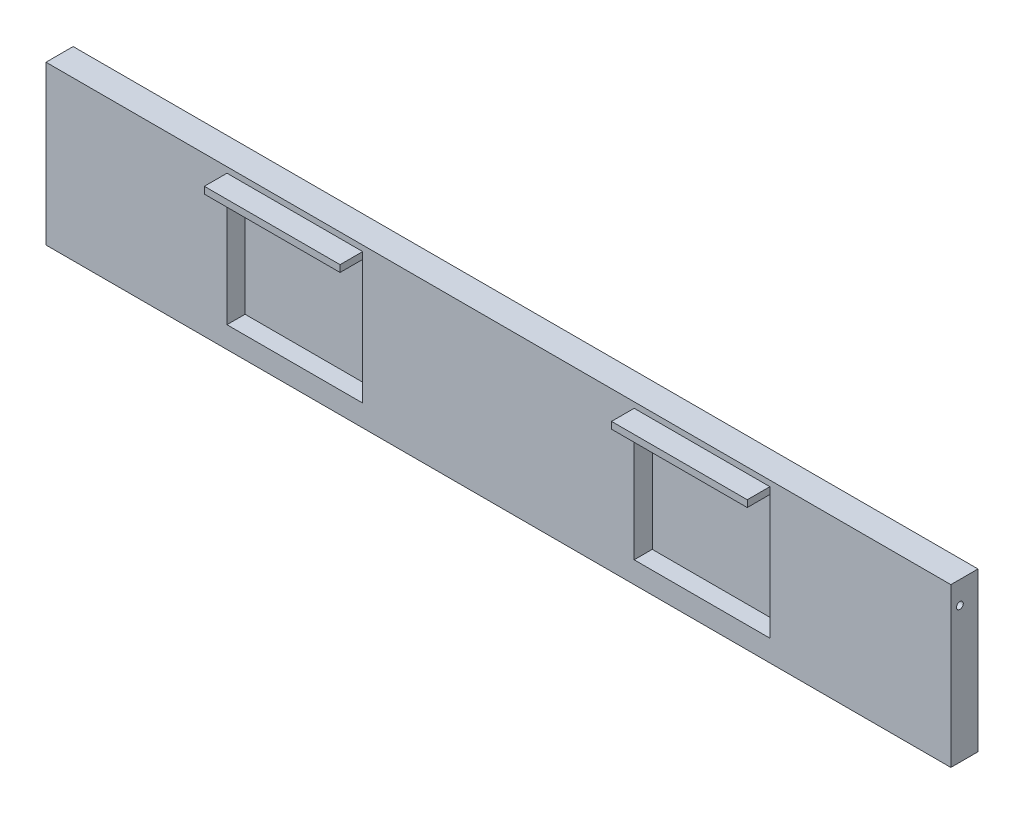
ISO-10303-21;
HEADER;
FILE_DESCRIPTION(('STEP AP214'),'2;1');
FILE_NAME('part.step','',(''),(''),'','','');
FILE_SCHEMA(('AUTOMOTIVE_DESIGN { 1 0 10303 214 1 1 1 1 }'));
ENDSEC;
DATA;
#1=APPLICATION_CONTEXT('core data for automotive mechanical design processes');
#2=APPLICATION_PROTOCOL_DEFINITION('international standard','automotive_design',2000,#1);
#3=PRODUCT_CONTEXT('',#1,'mechanical');
#4=PRODUCT('Part','Part','',(#3));
#5=PRODUCT_RELATED_PRODUCT_CATEGORY('part','',(#4));
#6=PRODUCT_DEFINITION_FORMATION('','',#4);
#7=PRODUCT_DEFINITION_CONTEXT('part definition',#1,'design');
#8=PRODUCT_DEFINITION('design','',#6,#7);
#9=PRODUCT_DEFINITION_SHAPE('','',#8);
#10=(LENGTH_UNIT() NAMED_UNIT(*) SI_UNIT(.MILLI.,.METRE.));
#11=(NAMED_UNIT(*) PLANE_ANGLE_UNIT() SI_UNIT($,.RADIAN.));
#12=(NAMED_UNIT(*) SI_UNIT($,.STERADIAN.) SOLID_ANGLE_UNIT());
#13=UNCERTAINTY_MEASURE_WITH_UNIT(LENGTH_MEASURE(1.E-05),#10,'distance_accuracy_value','');
#14=(GEOMETRIC_REPRESENTATION_CONTEXT(3) GLOBAL_UNCERTAINTY_ASSIGNED_CONTEXT((#13)) GLOBAL_UNIT_ASSIGNED_CONTEXT((#10,
#11,#12)) REPRESENTATION_CONTEXT('',''));
#15=CARTESIAN_POINT('',(0.,0.,0.));
#16=DIRECTION('',(0.,0.,1.));
#17=DIRECTION('',(1.,0.,0.));
#18=AXIS2_PLACEMENT_3D('',#15,#16,#17);
#19=CARTESIAN_POINT('',(0.,0.,12.));
#20=DIRECTION('',(0.,0.,-1.));
#21=DIRECTION('',(-1.,0.,0.));
#22=AXIS2_PLACEMENT_3D('',#19,#20,#21);
#23=PLANE('',#22);
#24=DIRECTION('',(0.,-1.,0.));
#25=VECTOR('',#24,1.);
#26=CARTESIAN_POINT('',(60.,29.5,12.));
#27=LINE('',#26,#25);
#28=CARTESIAN_POINT('',(60.,32.5,12.));
#29=VERTEX_POINT('',#28);
#30=CARTESIAN_POINT('',(60.,29.5,12.));
#31=VERTEX_POINT('',#30);
#32=EDGE_CURVE('E54',#29,#31,#27,.T.);
#33=ORIENTED_EDGE('',*,*,#32,.F.);
#34=DIRECTION('',(-1.,0.,0.));
#35=VECTOR('',#34,1.);
#36=CARTESIAN_POINT('',(120.,32.5,12.));
#37=LINE('',#36,#35);
#38=CARTESIAN_POINT('',(120.,32.5,12.));
#39=VERTEX_POINT('',#38);
#40=EDGE_CURVE('E192',#39,#29,#37,.T.);
#41=ORIENTED_EDGE('',*,*,#40,.F.);
#42=DIRECTION('',(0.,1.,0.));
#43=VECTOR('',#42,1.);
#44=CARTESIAN_POINT('',(120.,29.5,12.));
#45=LINE('',#44,#43);
#46=CARTESIAN_POINT('',(120.,29.5,12.));
#47=VERTEX_POINT('',#46);
#48=EDGE_CURVE('E189',#47,#39,#45,.T.);
#49=ORIENTED_EDGE('',*,*,#48,.F.);
#50=DIRECTION('',(0.,1.,0.));
#51=VECTOR('',#50,1.);
#52=CARTESIAN_POINT('',(120.,29.5,12.));
#53=LINE('',#52,#51);
#54=CARTESIAN_POINT('',(120.,-25.5,12.));
#55=VERTEX_POINT('',#54);
#56=EDGE_CURVE('E271',#55,#47,#53,.T.);
#57=ORIENTED_EDGE('',*,*,#56,.F.);
#58=DIRECTION('',(1.,0.,0.));
#59=VECTOR('',#58,1.);
#60=CARTESIAN_POINT('',(60.,-25.5,12.));
#61=LINE('',#60,#59);
#62=CARTESIAN_POINT('',(60.,-25.5,12.));
#63=VERTEX_POINT('',#62);
#64=EDGE_CURVE('E282',#63,#55,#61,.T.);
#65=ORIENTED_EDGE('',*,*,#64,.F.);
#66=DIRECTION('',(0.,-1.,0.));
#67=VECTOR('',#66,1.);
#68=CARTESIAN_POINT('',(60.,29.5,12.));
#69=LINE('',#68,#67);
#70=EDGE_CURVE('E61',#31,#63,#69,.T.);
#71=ORIENTED_EDGE('',*,*,#70,.F.);
#72=EDGE_LOOP('',(#33,#41,#49,#57,#65,#71));
#73=FACE_BOUND('',#72,.T.);
#74=DIRECTION('',(0.,1.,0.));
#75=VECTOR('',#74,1.);
#76=CARTESIAN_POINT('',(200.,-35.,12.));
#77=LINE('',#76,#75);
#78=CARTESIAN_POINT('',(200.,-35.,12.));
#79=VERTEX_POINT('',#78);
#80=CARTESIAN_POINT('',(200.,35.,12.));
#81=VERTEX_POINT('',#80);
#82=EDGE_CURVE('E294',#79,#81,#77,.T.);
#83=ORIENTED_EDGE('',*,*,#82,.T.);
#84=DIRECTION('',(-1.,0.,0.));
#85=VECTOR('',#84,1.);
#86=CARTESIAN_POINT('',(-200.,35.,12.));
#87=LINE('',#86,#85);
#88=CARTESIAN_POINT('',(-200.,35.,12.));
#89=VERTEX_POINT('',#88);
#90=EDGE_CURVE('E297',#81,#89,#87,.T.);
#91=ORIENTED_EDGE('',*,*,#90,.T.);
#92=DIRECTION('',(0.,-1.,0.));
#93=VECTOR('',#92,1.);
#94=CARTESIAN_POINT('',(-200.,-35.,12.));
#95=LINE('',#94,#93);
#96=CARTESIAN_POINT('',(-200.,-35.,12.));
#97=VERTEX_POINT('',#96);
#98=EDGE_CURVE('E300',#89,#97,#95,.T.);
#99=ORIENTED_EDGE('',*,*,#98,.T.);
#100=DIRECTION('',(1.,0.,0.));
#101=VECTOR('',#100,1.);
#102=CARTESIAN_POINT('',(-200.,-35.,12.));
#103=LINE('',#102,#101);
#104=EDGE_CURVE('E302',#97,#79,#103,.T.);
#105=ORIENTED_EDGE('',*,*,#104,.T.);
#106=EDGE_LOOP('',(#83,#91,#99,#105));
#107=FACE_BOUND('',#106,.T.);
#108=DIRECTION('',(0.,-1.,0.));
#109=VECTOR('',#108,1.);
#110=CARTESIAN_POINT('',(-120.,29.5,12.));
#111=LINE('',#110,#109);
#112=CARTESIAN_POINT('',(-120.,32.5,12.));
#113=VERTEX_POINT('',#112);
#114=CARTESIAN_POINT('',(-120.,29.5,12.));
#115=VERTEX_POINT('',#114);
#116=EDGE_CURVE('E188',#113,#115,#111,.T.);
#117=ORIENTED_EDGE('',*,*,#116,.F.);
#118=DIRECTION('',(-1.,0.,0.));
#119=VECTOR('',#118,1.);
#120=CARTESIAN_POINT('',(-120.,32.5,12.));
#121=LINE('',#120,#119);
#122=CARTESIAN_POINT('',(-60.,32.5,12.));
#123=VERTEX_POINT('',#122);
#124=EDGE_CURVE('E184',#123,#113,#121,.T.);
#125=ORIENTED_EDGE('',*,*,#124,.F.);
#126=DIRECTION('',(0.,1.,0.));
#127=VECTOR('',#126,1.);
#128=CARTESIAN_POINT('',(-60.,29.5,12.));
#129=LINE('',#128,#127);
#130=CARTESIAN_POINT('',(-60.,29.5,12.));
#131=VERTEX_POINT('',#130);
#132=EDGE_CURVE('E600',#131,#123,#129,.T.);
#133=ORIENTED_EDGE('',*,*,#132,.F.);
#134=DIRECTION('',(0.,1.,0.));
#135=VECTOR('',#134,1.);
#136=CARTESIAN_POINT('',(-60.,29.5,12.));
#137=LINE('',#136,#135);
#138=CARTESIAN_POINT('',(-60.,-25.5,12.));
#139=VERTEX_POINT('',#138);
#140=EDGE_CURVE('E250',#139,#131,#137,.T.);
#141=ORIENTED_EDGE('',*,*,#140,.F.);
#142=DIRECTION('',(1.,0.,0.));
#143=VECTOR('',#142,1.);
#144=CARTESIAN_POINT('',(-60.,-25.5,12.));
#145=LINE('',#144,#143);
#146=CARTESIAN_POINT('',(-120.,-25.5,12.));
#147=VERTEX_POINT('',#146);
#148=EDGE_CURVE('E240',#147,#139,#145,.T.);
#149=ORIENTED_EDGE('',*,*,#148,.F.);
#150=DIRECTION('',(0.,-1.,0.));
#151=VECTOR('',#150,1.);
#152=CARTESIAN_POINT('',(-120.,29.5,12.));
#153=LINE('',#152,#151);
#154=EDGE_CURVE('E253',#115,#147,#153,.T.);
#155=ORIENTED_EDGE('',*,*,#154,.F.);
#156=EDGE_LOOP('',(#117,#125,#133,#141,#149,#155));
#157=FACE_BOUND('',#156,.T.);
#158=ADVANCED_FACE('F38',(#73,#107,#157),#23,.F.);
#159=CARTESIAN_POINT('',(200.,-35.,12.));
#160=DIRECTION('',(-1.,0.,0.));
#161=DIRECTION('',(0.,0.,1.));
#162=AXIS2_PLACEMENT_3D('',#159,#160,#161);
#163=PLANE('',#162);
#164=CARTESIAN_POINT('',(200.,25.,8.));
#165=DIRECTION('',(-1.,0.,0.));
#166=DIRECTION('',(0.,0.,1.));
#167=AXIS2_PLACEMENT_3D('',#164,#165,#166);
#168=CIRCLE('',#167,1.5);
#169=CARTESIAN_POINT('',(200.,25.,9.5));
#170=VERTEX_POINT('',#169);
#171=EDGE_CURVE('E222',#170,#170,#168,.T.);
#172=ORIENTED_EDGE('',*,*,#171,.T.);
#173=EDGE_LOOP('',(#172));
#174=FACE_BOUND('',#173,.T.);
#175=DIRECTION('',(0.,1.,0.));
#176=VECTOR('',#175,1.);
#177=CARTESIAN_POINT('',(200.,-35.,0.));
#178=LINE('',#177,#176);
#179=CARTESIAN_POINT('',(200.,-35.,0.));
#180=VERTEX_POINT('',#179);
#181=CARTESIAN_POINT('',(200.,35.,0.));
#182=VERTEX_POINT('',#181);
#183=EDGE_CURVE('E261',#180,#182,#178,.T.);
#184=ORIENTED_EDGE('',*,*,#183,.T.);
#185=DIRECTION('',(0.,0.,-1.));
#186=VECTOR('',#185,1.);
#187=CARTESIAN_POINT('',(200.,35.,12.));
#188=LINE('',#187,#186);
#189=EDGE_CURVE('E11',#81,#182,#188,.T.);
#190=ORIENTED_EDGE('',*,*,#189,.F.);
#191=ORIENTED_EDGE('',*,*,#82,.F.);
#192=DIRECTION('',(0.,0.,-1.));
#193=VECTOR('',#192,1.);
#194=CARTESIAN_POINT('',(200.,-35.,12.));
#195=LINE('',#194,#193);
#196=EDGE_CURVE('E304',#79,#180,#195,.T.);
#197=ORIENTED_EDGE('',*,*,#196,.T.);
#198=EDGE_LOOP('',(#184,#190,#191,#197));
#199=FACE_BOUND('',#198,.T.);
#200=ADVANCED_FACE('F40',(#174,#199),#163,.F.);
#201=CARTESIAN_POINT('',(-200.,35.,12.));
#202=DIRECTION('',(0.,-1.,0.));
#203=DIRECTION('',(0.,0.,-1.));
#204=AXIS2_PLACEMENT_3D('',#201,#202,#203);
#205=PLANE('',#204);
#206=DIRECTION('',(-1.,0.,0.));
#207=VECTOR('',#206,1.);
#208=CARTESIAN_POINT('',(-200.,35.,0.));
#209=LINE('',#208,#207);
#210=CARTESIAN_POINT('',(-200.,35.,0.));
#211=VERTEX_POINT('',#210);
#212=EDGE_CURVE('E307',#182,#211,#209,.T.);
#213=ORIENTED_EDGE('',*,*,#212,.T.);
#214=DIRECTION('',(0.,0.,-1.));
#215=VECTOR('',#214,1.);
#216=CARTESIAN_POINT('',(-200.,35.,12.));
#217=LINE('',#216,#215);
#218=EDGE_CURVE('E47',#89,#211,#217,.T.);
#219=ORIENTED_EDGE('',*,*,#218,.F.);
#220=ORIENTED_EDGE('',*,*,#90,.F.);
#221=ORIENTED_EDGE('',*,*,#189,.T.);
#222=EDGE_LOOP('',(#213,#219,#220,#221));
#223=FACE_BOUND('',#222,.T.);
#224=ADVANCED_FACE('F338',(#223),#205,.F.);
#225=CARTESIAN_POINT('',(-200.,-35.,12.));
#226=DIRECTION('',(1.,0.,0.));
#227=DIRECTION('',(0.,0.,-1.));
#228=AXIS2_PLACEMENT_3D('',#225,#226,#227);
#229=PLANE('',#228);
#230=CARTESIAN_POINT('',(-200.,25.,8.));
#231=DIRECTION('',(-1.,0.,0.));
#232=DIRECTION('',(0.,0.,1.));
#233=AXIS2_PLACEMENT_3D('',#230,#231,#232);
#234=CIRCLE('',#233,1.5);
#235=CARTESIAN_POINT('',(-200.,25.,9.5));
#236=VERTEX_POINT('',#235);
#237=EDGE_CURVE('E221',#236,#236,#234,.T.);
#238=ORIENTED_EDGE('',*,*,#237,.F.);
#239=EDGE_LOOP('',(#238));
#240=FACE_BOUND('',#239,.T.);
#241=DIRECTION('',(0.,-1.,0.));
#242=VECTOR('',#241,1.);
#243=CARTESIAN_POINT('',(-200.,-35.,0.));
#244=LINE('',#243,#242);
#245=CARTESIAN_POINT('',(-200.,-35.,0.));
#246=VERTEX_POINT('',#245);
#247=EDGE_CURVE('E309',#211,#246,#244,.T.);
#248=ORIENTED_EDGE('',*,*,#247,.T.);
#249=DIRECTION('',(0.,0.,-1.));
#250=VECTOR('',#249,1.);
#251=CARTESIAN_POINT('',(-200.,-35.,12.));
#252=LINE('',#251,#250);
#253=EDGE_CURVE('E314',#97,#246,#252,.T.);
#254=ORIENTED_EDGE('',*,*,#253,.F.);
#255=ORIENTED_EDGE('',*,*,#98,.F.);
#256=ORIENTED_EDGE('',*,*,#218,.T.);
#257=EDGE_LOOP('',(#248,#254,#255,#256));
#258=FACE_BOUND('',#257,.T.);
#259=ADVANCED_FACE('F322',(#240,#258),#229,.F.);
#260=CARTESIAN_POINT('',(-200.,-35.,12.));
#261=DIRECTION('',(0.,1.,0.));
#262=DIRECTION('',(0.,0.,1.));
#263=AXIS2_PLACEMENT_3D('',#260,#261,#262);
#264=PLANE('',#263);
#265=DIRECTION('',(1.,0.,0.));
#266=VECTOR('',#265,1.);
#267=CARTESIAN_POINT('',(-200.,-35.,0.));
#268=LINE('',#267,#266);
#269=EDGE_CURVE('E298',#246,#180,#268,.T.);
#270=ORIENTED_EDGE('',*,*,#269,.T.);
#271=ORIENTED_EDGE('',*,*,#196,.F.);
#272=ORIENTED_EDGE('',*,*,#104,.F.);
#273=ORIENTED_EDGE('',*,*,#253,.T.);
#274=EDGE_LOOP('',(#270,#271,#272,#273));
#275=FACE_BOUND('',#274,.T.);
#276=ADVANCED_FACE('F331',(#275),#264,.F.);
#277=CARTESIAN_POINT('',(0.,0.,0.));
#278=DIRECTION('',(0.,0.,-1.));
#279=DIRECTION('',(-1.,0.,0.));
#280=AXIS2_PLACEMENT_3D('',#277,#278,#279);
#281=PLANE('',#280);
#282=ORIENTED_EDGE('',*,*,#183,.F.);
#283=ORIENTED_EDGE('',*,*,#269,.F.);
#284=ORIENTED_EDGE('',*,*,#247,.F.);
#285=ORIENTED_EDGE('',*,*,#212,.F.);
#286=EDGE_LOOP('',(#282,#283,#284,#285));
#287=FACE_BOUND('',#286,.T.);
#288=ADVANCED_FACE('F328',(#287),#281,.T.);
#289=CARTESIAN_POINT('',(60.,29.5,4.));
#290=DIRECTION('',(-1.,0.,0.));
#291=DIRECTION('',(0.,-1.,0.));
#292=AXIS2_PLACEMENT_3D('',#289,#290,#291);
#293=PLANE('',#292);
#294=CARTESIAN_POINT('',(60.,25.,8.));
#295=DIRECTION('',(-1.,0.,0.));
#296=DIRECTION('',(0.,-1.,0.));
#297=AXIS2_PLACEMENT_3D('',#294,#295,#296);
#298=CIRCLE('',#297,1.5);
#299=CARTESIAN_POINT('',(60.,23.5,8.));
#300=VERTEX_POINT('',#299);
#301=EDGE_CURVE('E233',#300,#300,#298,.T.);
#302=ORIENTED_EDGE('',*,*,#301,.T.);
#303=EDGE_LOOP('',(#302));
#304=FACE_BOUND('',#303,.T.);
#305=ORIENTED_EDGE('',*,*,#70,.T.);
#306=DIRECTION('',(0.,0.,1.));
#307=VECTOR('',#306,1.);
#308=CARTESIAN_POINT('',(60.,-25.5,4.));
#309=LINE('',#308,#307);
#310=CARTESIAN_POINT('',(60.,-25.5,4.));
#311=VERTEX_POINT('',#310);
#312=EDGE_CURVE('E280',#311,#63,#309,.T.);
#313=ORIENTED_EDGE('',*,*,#312,.F.);
#314=DIRECTION('',(0.,-1.,0.));
#315=VECTOR('',#314,1.);
#316=CARTESIAN_POINT('',(60.,29.5,4.));
#317=LINE('',#316,#315);
#318=CARTESIAN_POINT('',(60.,29.5,4.));
#319=VERTEX_POINT('',#318);
#320=EDGE_CURVE('E267',#319,#311,#317,.T.);
#321=ORIENTED_EDGE('',*,*,#320,.F.);
#322=DIRECTION('',(0.,0.,1.));
#323=VECTOR('',#322,1.);
#324=CARTESIAN_POINT('',(60.,29.5,4.));
#325=LINE('',#324,#323);
#326=EDGE_CURVE('E254',#319,#31,#325,.T.);
#327=ORIENTED_EDGE('',*,*,#326,.T.);
#328=EDGE_LOOP('',(#305,#313,#321,#327));
#329=FACE_BOUND('',#328,.T.);
#330=ADVANCED_FACE('F353',(#304,#329),#293,.F.);
#331=CARTESIAN_POINT('',(60.,29.5,4.));
#332=DIRECTION('',(0.,1.,0.));
#333=DIRECTION('',(-1.,0.,0.));
#334=AXIS2_PLACEMENT_3D('',#331,#332,#333);
#335=PLANE('',#334);
#336=DIRECTION('',(0.,0.,1.));
#337=VECTOR('',#336,1.);
#338=CARTESIAN_POINT('',(120.,29.5,4.));
#339=LINE('',#338,#337);
#340=CARTESIAN_POINT('',(120.,29.5,4.));
#341=VERTEX_POINT('',#340);
#342=EDGE_CURVE('E288',#341,#47,#339,.T.);
#343=ORIENTED_EDGE('',*,*,#342,.T.);
#344=DIRECTION('',(0.,0.,-1.));
#345=VECTOR('',#344,1.);
#346=CARTESIAN_POINT('',(120.,29.5,22.));
#347=LINE('',#346,#345);
#348=CARTESIAN_POINT('',(120.,29.5,22.));
#349=VERTEX_POINT('',#348);
#350=EDGE_CURVE('E218',#349,#47,#347,.T.);
#351=ORIENTED_EDGE('',*,*,#350,.F.);
#352=DIRECTION('',(1.,0.,0.));
#353=VECTOR('',#352,1.);
#354=CARTESIAN_POINT('',(120.,29.5,22.));
#355=LINE('',#354,#353);
#356=CARTESIAN_POINT('',(60.,29.5,22.));
#357=VERTEX_POINT('',#356);
#358=EDGE_CURVE('E198',#357,#349,#355,.T.);
#359=ORIENTED_EDGE('',*,*,#358,.F.);
#360=DIRECTION('',(0.,0.,-1.));
#361=VECTOR('',#360,1.);
#362=CARTESIAN_POINT('',(60.,29.5,22.));
#363=LINE('',#362,#361);
#364=EDGE_CURVE('E206',#357,#31,#363,.T.);
#365=ORIENTED_EDGE('',*,*,#364,.T.);
#366=ORIENTED_EDGE('',*,*,#326,.F.);
#367=DIRECTION('',(-1.,0.,0.));
#368=VECTOR('',#367,1.);
#369=CARTESIAN_POINT('',(60.,29.5,4.));
#370=LINE('',#369,#368);
#371=EDGE_CURVE('E277',#341,#319,#370,.T.);
#372=ORIENTED_EDGE('',*,*,#371,.F.);
#373=EDGE_LOOP('',(#343,#351,#359,#365,#366,#372));
#374=FACE_BOUND('',#373,.T.);
#375=ADVANCED_FACE('F373',(#374),#335,.F.);
#376=CARTESIAN_POINT('',(120.,29.5,4.));
#377=DIRECTION('',(1.,0.,0.));
#378=DIRECTION('',(0.,0.,-1.));
#379=AXIS2_PLACEMENT_3D('',#376,#377,#378);
#380=PLANE('',#379);
#381=CARTESIAN_POINT('',(120.,25.,8.));
#382=DIRECTION('',(1.,0.,0.));
#383=DIRECTION('',(0.,0.,-1.));
#384=AXIS2_PLACEMENT_3D('',#381,#382,#383);
#385=CIRCLE('',#384,1.5);
#386=CARTESIAN_POINT('',(120.,25.,6.5));
#387=VERTEX_POINT('',#386);
#388=EDGE_CURVE('E230',#387,#387,#385,.T.);
#389=ORIENTED_EDGE('',*,*,#388,.T.);
#390=EDGE_LOOP('',(#389));
#391=FACE_BOUND('',#390,.T.);
#392=ORIENTED_EDGE('',*,*,#56,.T.);
#393=ORIENTED_EDGE('',*,*,#342,.F.);
#394=DIRECTION('',(0.,1.,0.));
#395=VECTOR('',#394,1.);
#396=CARTESIAN_POINT('',(120.,29.5,4.));
#397=LINE('',#396,#395);
#398=CARTESIAN_POINT('',(120.,-25.5,4.));
#399=VERTEX_POINT('',#398);
#400=EDGE_CURVE('E274',#399,#341,#397,.T.);
#401=ORIENTED_EDGE('',*,*,#400,.F.);
#402=DIRECTION('',(0.,0.,1.));
#403=VECTOR('',#402,1.);
#404=CARTESIAN_POINT('',(120.,-25.5,4.));
#405=LINE('',#404,#403);
#406=EDGE_CURVE('E291',#399,#55,#405,.T.);
#407=ORIENTED_EDGE('',*,*,#406,.T.);
#408=EDGE_LOOP('',(#392,#393,#401,#407));
#409=FACE_BOUND('',#408,.T.);
#410=ADVANCED_FACE('F380',(#391,#409),#380,.F.);
#411=CARTESIAN_POINT('',(60.,-25.5,4.));
#412=DIRECTION('',(0.,-1.,0.));
#413=DIRECTION('',(0.,0.,-1.));
#414=AXIS2_PLACEMENT_3D('',#411,#412,#413);
#415=PLANE('',#414);
#416=ORIENTED_EDGE('',*,*,#64,.T.);
#417=ORIENTED_EDGE('',*,*,#406,.F.);
#418=DIRECTION('',(1.,0.,0.));
#419=VECTOR('',#418,1.);
#420=CARTESIAN_POINT('',(60.,-25.5,4.));
#421=LINE('',#420,#419);
#422=EDGE_CURVE('E270',#311,#399,#421,.T.);
#423=ORIENTED_EDGE('',*,*,#422,.F.);
#424=ORIENTED_EDGE('',*,*,#312,.T.);
#425=EDGE_LOOP('',(#416,#417,#423,#424));
#426=FACE_BOUND('',#425,.T.);
#427=ADVANCED_FACE('F388',(#426),#415,.F.);
#428=CARTESIAN_POINT('',(0.,0.,4.));
#429=DIRECTION('',(0.,0.,1.));
#430=DIRECTION('',(1.,0.,0.));
#431=AXIS2_PLACEMENT_3D('',#428,#429,#430);
#432=PLANE('',#431);
#433=ORIENTED_EDGE('',*,*,#320,.T.);
#434=ORIENTED_EDGE('',*,*,#422,.T.);
#435=ORIENTED_EDGE('',*,*,#400,.T.);
#436=ORIENTED_EDGE('',*,*,#371,.T.);
#437=EDGE_LOOP('',(#433,#434,#435,#436));
#438=FACE_BOUND('',#437,.T.);
#439=ADVANCED_FACE('F396',(#438),#432,.T.);
#440=CARTESIAN_POINT('',(-60.,29.5,4.));
#441=DIRECTION('',(1.,0.,0.));
#442=DIRECTION('',(0.,0.,-1.));
#443=AXIS2_PLACEMENT_3D('',#440,#441,#442);
#444=PLANE('',#443);
#445=CARTESIAN_POINT('',(-60.,25.,8.));
#446=DIRECTION('',(1.,0.,0.));
#447=DIRECTION('',(0.,0.,-1.));
#448=AXIS2_PLACEMENT_3D('',#445,#446,#447);
#449=CIRCLE('',#448,1.5);
#450=CARTESIAN_POINT('',(-60.,25.,6.5));
#451=VERTEX_POINT('',#450);
#452=EDGE_CURVE('E227',#451,#451,#449,.T.);
#453=ORIENTED_EDGE('',*,*,#452,.T.);
#454=EDGE_LOOP('',(#453));
#455=FACE_BOUND('',#454,.T.);
#456=ORIENTED_EDGE('',*,*,#140,.T.);
#457=DIRECTION('',(0.,0.,1.));
#458=VECTOR('',#457,1.);
#459=CARTESIAN_POINT('',(-60.,29.5,4.));
#460=LINE('',#459,#458);
#461=CARTESIAN_POINT('',(-60.,29.5,4.));
#462=VERTEX_POINT('',#461);
#463=EDGE_CURVE('E249',#462,#131,#460,.T.);
#464=ORIENTED_EDGE('',*,*,#463,.F.);
#465=DIRECTION('',(0.,1.,0.));
#466=VECTOR('',#465,1.);
#467=CARTESIAN_POINT('',(-60.,29.5,4.));
#468=LINE('',#467,#466);
#469=CARTESIAN_POINT('',(-60.,-25.5,4.));
#470=VERTEX_POINT('',#469);
#471=EDGE_CURVE('E236',#470,#462,#468,.T.);
#472=ORIENTED_EDGE('',*,*,#471,.F.);
#473=DIRECTION('',(0.,0.,1.));
#474=VECTOR('',#473,1.);
#475=CARTESIAN_POINT('',(-60.,-25.5,4.));
#476=LINE('',#475,#474);
#477=EDGE_CURVE('E259',#470,#139,#476,.T.);
#478=ORIENTED_EDGE('',*,*,#477,.T.);
#479=EDGE_LOOP('',(#456,#464,#472,#478));
#480=FACE_BOUND('',#479,.T.);
#481=ADVANCED_FACE('F403',(#455,#480),#444,.F.);
#482=CARTESIAN_POINT('',(-60.,-25.5,4.));
#483=DIRECTION('',(0.,-1.,0.));
#484=DIRECTION('',(1.,0.,0.));
#485=AXIS2_PLACEMENT_3D('',#482,#483,#484);
#486=PLANE('',#485);
#487=ORIENTED_EDGE('',*,*,#148,.T.);
#488=ORIENTED_EDGE('',*,*,#477,.F.);
#489=DIRECTION('',(1.,0.,0.));
#490=VECTOR('',#489,1.);
#491=CARTESIAN_POINT('',(-60.,-25.5,4.));
#492=LINE('',#491,#490);
#493=CARTESIAN_POINT('',(-120.,-25.5,4.));
#494=VERTEX_POINT('',#493);
#495=EDGE_CURVE('E246',#494,#470,#492,.T.);
#496=ORIENTED_EDGE('',*,*,#495,.F.);
#497=DIRECTION('',(0.,0.,1.));
#498=VECTOR('',#497,1.);
#499=CARTESIAN_POINT('',(-120.,-25.5,4.));
#500=LINE('',#499,#498);
#501=EDGE_CURVE('E262',#494,#147,#500,.T.);
#502=ORIENTED_EDGE('',*,*,#501,.T.);
#503=EDGE_LOOP('',(#487,#488,#496,#502));
#504=FACE_BOUND('',#503,.T.);
#505=ADVANCED_FACE('F411',(#504),#486,.F.);
#506=CARTESIAN_POINT('',(-120.,29.5,4.));
#507=DIRECTION('',(-1.,0.,0.));
#508=DIRECTION('',(0.,-1.,0.));
#509=AXIS2_PLACEMENT_3D('',#506,#507,#508);
#510=PLANE('',#509);
#511=CARTESIAN_POINT('',(-120.,25.,8.));
#512=DIRECTION('',(-1.,0.,0.));
#513=DIRECTION('',(0.,-1.,0.));
#514=AXIS2_PLACEMENT_3D('',#511,#512,#513);
#515=CIRCLE('',#514,1.5);
#516=CARTESIAN_POINT('',(-120.,23.5,8.));
#517=VERTEX_POINT('',#516);
#518=EDGE_CURVE('E42',#517,#517,#515,.T.);
#519=ORIENTED_EDGE('',*,*,#518,.T.);
#520=EDGE_LOOP('',(#519));
#521=FACE_BOUND('',#520,.T.);
#522=ORIENTED_EDGE('',*,*,#154,.T.);
#523=ORIENTED_EDGE('',*,*,#501,.F.);
#524=DIRECTION('',(0.,-1.,0.));
#525=VECTOR('',#524,1.);
#526=CARTESIAN_POINT('',(-120.,29.5,4.));
#527=LINE('',#526,#525);
#528=CARTESIAN_POINT('',(-120.,29.5,4.));
#529=VERTEX_POINT('',#528);
#530=EDGE_CURVE('E243',#529,#494,#527,.T.);
#531=ORIENTED_EDGE('',*,*,#530,.F.);
#532=DIRECTION('',(0.,0.,1.));
#533=VECTOR('',#532,1.);
#534=CARTESIAN_POINT('',(-120.,29.5,4.));
#535=LINE('',#534,#533);
#536=EDGE_CURVE('E264',#529,#115,#535,.T.);
#537=ORIENTED_EDGE('',*,*,#536,.T.);
#538=EDGE_LOOP('',(#522,#523,#531,#537));
#539=FACE_BOUND('',#538,.T.);
#540=ADVANCED_FACE('F419',(#521,#539),#510,.F.);
#541=CARTESIAN_POINT('',(-60.,29.5,4.));
#542=DIRECTION('',(0.,1.,0.));
#543=DIRECTION('',(-1.,0.,0.));
#544=AXIS2_PLACEMENT_3D('',#541,#542,#543);
#545=PLANE('',#544);
#546=ORIENTED_EDGE('',*,*,#463,.T.);
#547=DIRECTION('',(0.,0.,-1.));
#548=VECTOR('',#547,1.);
#549=CARTESIAN_POINT('',(-60.,29.5,22.));
#550=LINE('',#549,#548);
#551=CARTESIAN_POINT('',(-60.,29.5,22.));
#552=VERTEX_POINT('',#551);
#553=EDGE_CURVE('E171',#552,#131,#550,.T.);
#554=ORIENTED_EDGE('',*,*,#553,.F.);
#555=DIRECTION('',(1.,0.,0.));
#556=VECTOR('',#555,1.);
#557=CARTESIAN_POINT('',(-120.,29.5,22.));
#558=LINE('',#557,#556);
#559=CARTESIAN_POINT('',(-120.,29.5,22.));
#560=VERTEX_POINT('',#559);
#561=EDGE_CURVE('E164',#560,#552,#558,.T.);
#562=ORIENTED_EDGE('',*,*,#561,.F.);
#563=DIRECTION('',(0.,0.,-1.));
#564=VECTOR('',#563,1.);
#565=CARTESIAN_POINT('',(-120.,29.5,22.));
#566=LINE('',#565,#564);
#567=EDGE_CURVE('E169',#560,#115,#566,.T.);
#568=ORIENTED_EDGE('',*,*,#567,.T.);
#569=ORIENTED_EDGE('',*,*,#536,.F.);
#570=DIRECTION('',(-1.,0.,0.));
#571=VECTOR('',#570,1.);
#572=CARTESIAN_POINT('',(-60.,29.5,4.));
#573=LINE('',#572,#571);
#574=EDGE_CURVE('E239',#462,#529,#573,.T.);
#575=ORIENTED_EDGE('',*,*,#574,.F.);
#576=EDGE_LOOP('',(#546,#554,#562,#568,#569,#575));
#577=FACE_BOUND('',#576,.T.);
#578=ADVANCED_FACE('F167',(#577),#545,.F.);
#579=CARTESIAN_POINT('',(0.,0.,4.));
#580=DIRECTION('',(0.,0.,-1.));
#581=DIRECTION('',(-1.,0.,0.));
#582=AXIS2_PLACEMENT_3D('',#579,#580,#581);
#583=PLANE('',#582);
#584=ORIENTED_EDGE('',*,*,#471,.T.);
#585=ORIENTED_EDGE('',*,*,#574,.T.);
#586=ORIENTED_EDGE('',*,*,#530,.T.);
#587=ORIENTED_EDGE('',*,*,#495,.T.);
#588=EDGE_LOOP('',(#584,#585,#586,#587));
#589=FACE_BOUND('',#588,.T.);
#590=ADVANCED_FACE('F434',(#589),#583,.F.);
#591=CARTESIAN_POINT('',(200.,25.,8.));
#592=DIRECTION('',(-1.,0.,0.));
#593=DIRECTION('',(0.,0.,1.));
#594=AXIS2_PLACEMENT_3D('',#591,#592,#593);
#595=CYLINDRICAL_SURFACE('',#594,1.5);
#596=ORIENTED_EDGE('',*,*,#237,.T.);
#597=EDGE_LOOP('',(#596));
#598=FACE_BOUND('',#597,.T.);
#599=ORIENTED_EDGE('',*,*,#518,.F.);
#600=EDGE_LOOP('',(#599));
#601=FACE_BOUND('',#600,.T.);
#602=ADVANCED_FACE('F441',(#598,#601),#595,.F.);
#603=ORIENTED_EDGE('',*,*,#452,.F.);
#604=EDGE_LOOP('',(#603));
#605=FACE_BOUND('',#604,.T.);
#606=ORIENTED_EDGE('',*,*,#301,.F.);
#607=EDGE_LOOP('',(#606));
#608=FACE_BOUND('',#607,.T.);
#609=ADVANCED_FACE('F450',(#605,#608),#595,.F.);
#610=ORIENTED_EDGE('',*,*,#171,.F.);
#611=EDGE_LOOP('',(#610));
#612=FACE_BOUND('',#611,.T.);
#613=ORIENTED_EDGE('',*,*,#388,.F.);
#614=EDGE_LOOP('',(#613));
#615=FACE_BOUND('',#614,.T.);
#616=ADVANCED_FACE('F453',(#612,#615),#595,.F.);
#617=CARTESIAN_POINT('',(120.,29.5,22.));
#618=DIRECTION('',(-1.,0.,0.));
#619=DIRECTION('',(0.,0.,1.));
#620=AXIS2_PLACEMENT_3D('',#617,#618,#619);
#621=PLANE('',#620);
#622=ORIENTED_EDGE('',*,*,#48,.T.);
#623=DIRECTION('',(0.,0.,-1.));
#624=VECTOR('',#623,1.);
#625=CARTESIAN_POINT('',(120.,32.5,22.));
#626=LINE('',#625,#624);
#627=CARTESIAN_POINT('',(120.,32.5,22.));
#628=VERTEX_POINT('',#627);
#629=EDGE_CURVE('E215',#628,#39,#626,.T.);
#630=ORIENTED_EDGE('',*,*,#629,.F.);
#631=DIRECTION('',(0.,1.,0.));
#632=VECTOR('',#631,1.);
#633=CARTESIAN_POINT('',(120.,29.5,22.));
#634=LINE('',#633,#632);
#635=EDGE_CURVE('E201',#349,#628,#634,.T.);
#636=ORIENTED_EDGE('',*,*,#635,.F.);
#637=ORIENTED_EDGE('',*,*,#350,.T.);
#638=EDGE_LOOP('',(#622,#630,#636,#637));
#639=FACE_BOUND('',#638,.T.);
#640=ADVANCED_FACE('F465',(#639),#621,.F.);
#641=CARTESIAN_POINT('',(120.,32.5,22.));
#642=DIRECTION('',(0.,-1.,0.));
#643=DIRECTION('',(0.,0.,-1.));
#644=AXIS2_PLACEMENT_3D('',#641,#642,#643);
#645=PLANE('',#644);
#646=ORIENTED_EDGE('',*,*,#40,.T.);
#647=DIRECTION('',(0.,0.,-1.));
#648=VECTOR('',#647,1.);
#649=CARTESIAN_POINT('',(60.,32.5,22.));
#650=LINE('',#649,#648);
#651=CARTESIAN_POINT('',(60.,32.5,22.));
#652=VERTEX_POINT('',#651);
#653=EDGE_CURVE('E212',#652,#29,#650,.T.);
#654=ORIENTED_EDGE('',*,*,#653,.F.);
#655=DIRECTION('',(-1.,0.,0.));
#656=VECTOR('',#655,1.);
#657=CARTESIAN_POINT('',(120.,32.5,22.));
#658=LINE('',#657,#656);
#659=EDGE_CURVE('E203',#628,#652,#658,.T.);
#660=ORIENTED_EDGE('',*,*,#659,.F.);
#661=ORIENTED_EDGE('',*,*,#629,.T.);
#662=EDGE_LOOP('',(#646,#654,#660,#661));
#663=FACE_BOUND('',#662,.T.);
#664=ADVANCED_FACE('F471',(#663),#645,.F.);
#665=CARTESIAN_POINT('',(60.,29.5,22.));
#666=DIRECTION('',(1.,0.,0.));
#667=DIRECTION('',(0.,0.,-1.));
#668=AXIS2_PLACEMENT_3D('',#665,#666,#667);
#669=PLANE('',#668);
#670=ORIENTED_EDGE('',*,*,#32,.T.);
#671=ORIENTED_EDGE('',*,*,#364,.F.);
#672=DIRECTION('',(0.,-1.,0.));
#673=VECTOR('',#672,1.);
#674=CARTESIAN_POINT('',(60.,29.5,22.));
#675=LINE('',#674,#673);
#676=EDGE_CURVE('E205',#652,#357,#675,.T.);
#677=ORIENTED_EDGE('',*,*,#676,.F.);
#678=ORIENTED_EDGE('',*,*,#653,.T.);
#679=EDGE_LOOP('',(#670,#671,#677,#678));
#680=FACE_BOUND('',#679,.T.);
#681=ADVANCED_FACE('F479',(#680),#669,.F.);
#682=CARTESIAN_POINT('',(0.,0.,22.));
#683=DIRECTION('',(0.,0.,-1.));
#684=DIRECTION('',(-1.,0.,0.));
#685=AXIS2_PLACEMENT_3D('',#682,#683,#684);
#686=PLANE('',#685);
#687=ORIENTED_EDGE('',*,*,#358,.T.);
#688=ORIENTED_EDGE('',*,*,#635,.T.);
#689=ORIENTED_EDGE('',*,*,#659,.T.);
#690=ORIENTED_EDGE('',*,*,#676,.T.);
#691=EDGE_LOOP('',(#687,#688,#689,#690));
#692=FACE_BOUND('',#691,.T.);
#693=ADVANCED_FACE('F487',(#692),#686,.F.);
#694=CARTESIAN_POINT('',(-120.,29.5,22.));
#695=DIRECTION('',(1.,0.,0.));
#696=DIRECTION('',(0.,0.,-1.));
#697=AXIS2_PLACEMENT_3D('',#694,#695,#696);
#698=PLANE('',#697);
#699=ORIENTED_EDGE('',*,*,#116,.T.);
#700=ORIENTED_EDGE('',*,*,#567,.F.);
#701=DIRECTION('',(0.,-1.,0.));
#702=VECTOR('',#701,1.);
#703=CARTESIAN_POINT('',(-120.,29.5,22.));
#704=LINE('',#703,#702);
#705=CARTESIAN_POINT('',(-120.,32.5,22.));
#706=VERTEX_POINT('',#705);
#707=EDGE_CURVE('E175',#706,#560,#704,.T.);
#708=ORIENTED_EDGE('',*,*,#707,.F.);
#709=DIRECTION('',(0.,0.,-1.));
#710=VECTOR('',#709,1.);
#711=CARTESIAN_POINT('',(-120.,32.5,22.));
#712=LINE('',#711,#710);
#713=EDGE_CURVE('E597',#706,#113,#712,.T.);
#714=ORIENTED_EDGE('',*,*,#713,.T.);
#715=EDGE_LOOP('',(#699,#700,#708,#714));
#716=FACE_BOUND('',#715,.T.);
#717=ADVANCED_FACE('F186',(#716),#698,.F.);
#718=CARTESIAN_POINT('',(-60.,29.5,22.));
#719=DIRECTION('',(-1.,0.,0.));
#720=DIRECTION('',(0.,0.,1.));
#721=AXIS2_PLACEMENT_3D('',#718,#719,#720);
#722=PLANE('',#721);
#723=ORIENTED_EDGE('',*,*,#132,.T.);
#724=DIRECTION('',(0.,0.,-1.));
#725=VECTOR('',#724,1.);
#726=CARTESIAN_POINT('',(-60.,32.5,22.));
#727=LINE('',#726,#725);
#728=CARTESIAN_POINT('',(-60.,32.5,22.));
#729=VERTEX_POINT('',#728);
#730=EDGE_CURVE('E194',#729,#123,#727,.T.);
#731=ORIENTED_EDGE('',*,*,#730,.F.);
#732=DIRECTION('',(0.,1.,0.));
#733=VECTOR('',#732,1.);
#734=CARTESIAN_POINT('',(-60.,29.5,22.));
#735=LINE('',#734,#733);
#736=EDGE_CURVE('E174',#552,#729,#735,.T.);
#737=ORIENTED_EDGE('',*,*,#736,.F.);
#738=ORIENTED_EDGE('',*,*,#553,.T.);
#739=EDGE_LOOP('',(#723,#731,#737,#738));
#740=FACE_BOUND('',#739,.T.);
#741=ADVANCED_FACE('F502',(#740),#722,.F.);
#742=CARTESIAN_POINT('',(-120.,32.5,22.));
#743=DIRECTION('',(0.,-1.,0.));
#744=DIRECTION('',(0.,0.,-1.));
#745=AXIS2_PLACEMENT_3D('',#742,#743,#744);
#746=PLANE('',#745);
#747=ORIENTED_EDGE('',*,*,#124,.T.);
#748=ORIENTED_EDGE('',*,*,#713,.F.);
#749=DIRECTION('',(-1.,0.,0.));
#750=VECTOR('',#749,1.);
#751=CARTESIAN_POINT('',(-120.,32.5,22.));
#752=LINE('',#751,#750);
#753=EDGE_CURVE('E180',#729,#706,#752,.T.);
#754=ORIENTED_EDGE('',*,*,#753,.F.);
#755=ORIENTED_EDGE('',*,*,#730,.T.);
#756=EDGE_LOOP('',(#747,#748,#754,#755));
#757=FACE_BOUND('',#756,.T.);
#758=ADVANCED_FACE('F509',(#757),#746,.F.);
#759=CARTESIAN_POINT('',(0.,0.,22.));
#760=DIRECTION('',(0.,0.,-1.));
#761=DIRECTION('',(-1.,0.,0.));
#762=AXIS2_PLACEMENT_3D('',#759,#760,#761);
#763=PLANE('',#762);
#764=ORIENTED_EDGE('',*,*,#707,.T.);
#765=ORIENTED_EDGE('',*,*,#561,.T.);
#766=ORIENTED_EDGE('',*,*,#736,.T.);
#767=ORIENTED_EDGE('',*,*,#753,.T.);
#768=EDGE_LOOP('',(#764,#765,#766,#767));
#769=FACE_BOUND('',#768,.T.);
#770=ADVANCED_FACE('F178',(#769),#763,.F.);
#771=CLOSED_SHELL('',(#158,#200,#224,#259,#276,#288,#330,#375,#410,#427,#439,#481,#505,#540,
#578,#590,#602,#609,#616,#640,#664,#681,#693,#717,#741,#758,#770));
#772=MANIFOLD_SOLID_BREP('B2',#771);
#773=ADVANCED_BREP_SHAPE_REPRESENTATION('',(#18,#772),#14);
#774=SHAPE_DEFINITION_REPRESENTATION(#9,#773);
ENDSEC;
END-ISO-10303-21;
